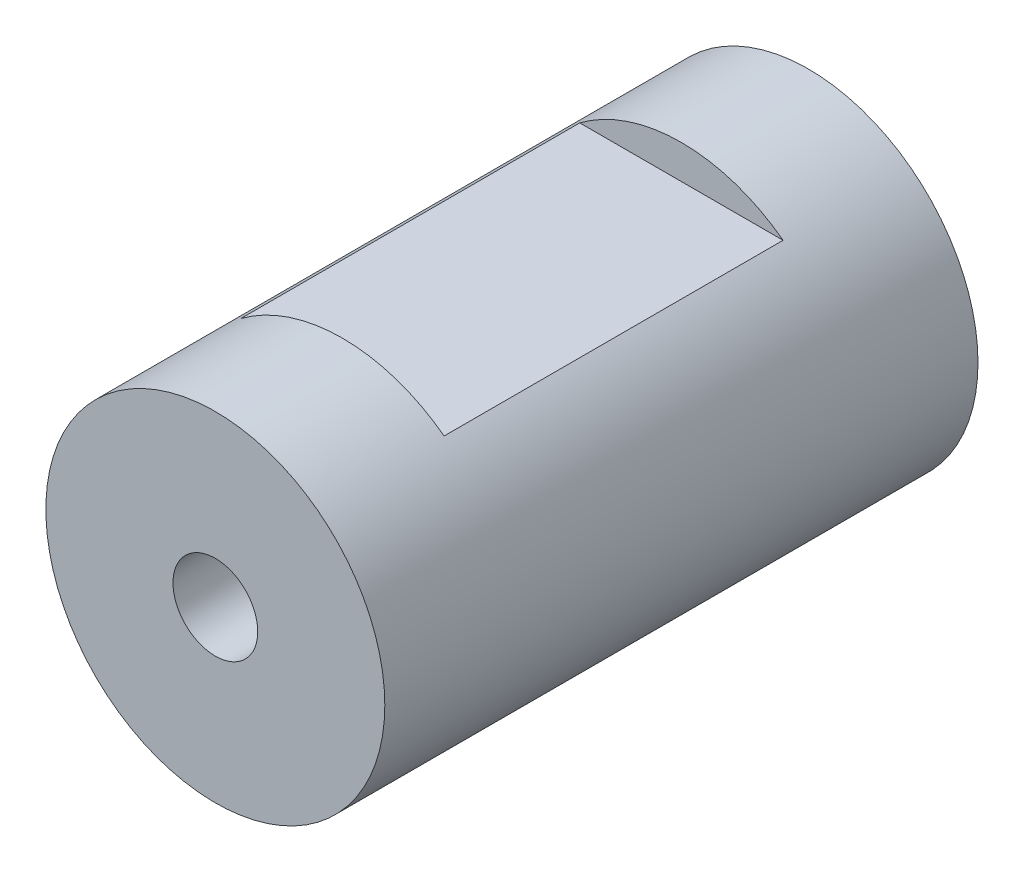
ISO-10303-21;
HEADER;
FILE_DESCRIPTION(('STEP AP214'),'2;1');
FILE_NAME('part.step','',(''),(''),'','','');
FILE_SCHEMA(('AUTOMOTIVE_DESIGN { 1 0 10303 214 1 1 1 1 }'));
ENDSEC;
DATA;
#1=APPLICATION_CONTEXT('core data for automotive mechanical design processes');
#2=APPLICATION_PROTOCOL_DEFINITION('international standard','automotive_design',2000,#1);
#3=PRODUCT_CONTEXT('',#1,'mechanical');
#4=PRODUCT('Part','Part','',(#3));
#5=PRODUCT_RELATED_PRODUCT_CATEGORY('part','',(#4));
#6=PRODUCT_DEFINITION_FORMATION('','',#4);
#7=PRODUCT_DEFINITION_CONTEXT('part definition',#1,'design');
#8=PRODUCT_DEFINITION('design','',#6,#7);
#9=PRODUCT_DEFINITION_SHAPE('','',#8);
#10=(LENGTH_UNIT() NAMED_UNIT(*) SI_UNIT(.MILLI.,.METRE.));
#11=(NAMED_UNIT(*) PLANE_ANGLE_UNIT() SI_UNIT($,.RADIAN.));
#12=(NAMED_UNIT(*) SI_UNIT($,.STERADIAN.) SOLID_ANGLE_UNIT());
#13=UNCERTAINTY_MEASURE_WITH_UNIT(LENGTH_MEASURE(1.E-05),#10,'distance_accuracy_value','');
#14=(GEOMETRIC_REPRESENTATION_CONTEXT(3) GLOBAL_UNCERTAINTY_ASSIGNED_CONTEXT((#13)) GLOBAL_UNIT_ASSIGNED_CONTEXT((#10,
#11,#12)) REPRESENTATION_CONTEXT('',''));
#15=CARTESIAN_POINT('',(0.,0.,0.));
#16=DIRECTION('',(0.,0.,1.));
#17=DIRECTION('',(1.,0.,0.));
#18=AXIS2_PLACEMENT_3D('',#15,#16,#17);
#19=CARTESIAN_POINT('',(0.,0.,-35.));
#20=DIRECTION('',(0.,0.,1.));
#21=DIRECTION('',(1.,0.,0.));
#22=AXIS2_PLACEMENT_3D('',#19,#20,#21);
#23=CYLINDRICAL_SURFACE('',#22,20.);
#24=CARTESIAN_POINT('',(0.,0.,20.));
#25=DIRECTION('',(0.,0.,1.));
#26=DIRECTION('',(1.,0.,0.));
#27=AXIS2_PLACEMENT_3D('',#24,#25,#26);
#28=CIRCLE('',#27,20.);
#29=CARTESIAN_POINT('',(-12.,16.,20.));
#30=VERTEX_POINT('',#29);
#31=CARTESIAN_POINT('',(12.,16.,20.));
#32=VERTEX_POINT('',#31);
#33=EDGE_CURVE('E77',#30,#32,#28,.F.);
#34=ORIENTED_EDGE('',*,*,#33,.F.);
#35=DIRECTION('',(0.,0.,1.));
#36=VECTOR('',#35,1.);
#37=CARTESIAN_POINT('',(-12.,16.,-35.));
#38=LINE('',#37,#36);
#39=CARTESIAN_POINT('',(-12.,16.,-20.));
#40=VERTEX_POINT('',#39);
#41=EDGE_CURVE('E14',#40,#30,#38,.T.);
#42=ORIENTED_EDGE('',*,*,#41,.F.);
#43=CARTESIAN_POINT('',(0.,0.,-20.));
#44=DIRECTION('',(0.,0.,-1.));
#45=DIRECTION('',(-1.,0.,0.));
#46=AXIS2_PLACEMENT_3D('',#43,#44,#45);
#47=CIRCLE('',#46,20.);
#48=CARTESIAN_POINT('',(12.,16.,-20.));
#49=VERTEX_POINT('',#48);
#50=EDGE_CURVE('E60',#49,#40,#47,.F.);
#51=ORIENTED_EDGE('',*,*,#50,.F.);
#52=DIRECTION('',(0.,0.,1.));
#53=VECTOR('',#52,1.);
#54=CARTESIAN_POINT('',(12.,16.,-35.));
#55=LINE('',#54,#53);
#56=EDGE_CURVE('E79',#32,#49,#55,.F.);
#57=ORIENTED_EDGE('',*,*,#56,.F.);
#58=EDGE_LOOP('',(#34,#42,#51,#57));
#59=FACE_BOUND('',#58,.T.);
#60=CARTESIAN_POINT('',(0.,0.,-35.));
#61=DIRECTION('',(0.,0.,1.));
#62=DIRECTION('',(1.,0.,0.));
#63=AXIS2_PLACEMENT_3D('',#60,#61,#62);
#64=CIRCLE('',#63,20.);
#65=CARTESIAN_POINT('',(20.,0.,-35.));
#66=VERTEX_POINT('',#65);
#67=EDGE_CURVE('E83',#66,#66,#64,.T.);
#68=ORIENTED_EDGE('',*,*,#67,.T.);
#69=EDGE_LOOP('',(#68));
#70=FACE_BOUND('',#69,.T.);
#71=CARTESIAN_POINT('',(0.,0.,35.));
#72=DIRECTION('',(0.,0.,1.));
#73=DIRECTION('',(1.,0.,0.));
#74=AXIS2_PLACEMENT_3D('',#71,#72,#73);
#75=CIRCLE('',#74,20.);
#76=CARTESIAN_POINT('',(20.,0.,35.));
#77=VERTEX_POINT('',#76);
#78=EDGE_CURVE('E111',#77,#77,#75,.T.);
#79=ORIENTED_EDGE('',*,*,#78,.F.);
#80=EDGE_LOOP('',(#79));
#81=FACE_BOUND('',#80,.T.);
#82=ADVANCED_FACE('F53',(#59,#70,#81),#23,.T.);
#83=CARTESIAN_POINT('',(0.,0.,-35.));
#84=DIRECTION('',(0.,0.,1.));
#85=DIRECTION('',(1.,0.,0.));
#86=AXIS2_PLACEMENT_3D('',#83,#84,#85);
#87=PLANE('',#86);
#88=CARTESIAN_POINT('',(0.,0.,-35.));
#89=DIRECTION('',(0.,0.,-1.));
#90=DIRECTION('',(-1.,0.,0.));
#91=AXIS2_PLACEMENT_3D('',#88,#89,#90);
#92=CIRCLE('',#91,5.);
#93=CARTESIAN_POINT('',(-4.99999999999999,0.,-35.));
#94=VERTEX_POINT('',#93);
#95=EDGE_CURVE('E108',#94,#94,#92,.F.);
#96=ORIENTED_EDGE('',*,*,#95,.T.);
#97=EDGE_LOOP('',(#96));
#98=FACE_BOUND('',#97,.T.);
#99=ORIENTED_EDGE('',*,*,#67,.F.);
#100=EDGE_LOOP('',(#99));
#101=FACE_BOUND('',#100,.T.);
#102=ADVANCED_FACE('F130',(#98,#101),#87,.F.);
#103=CARTESIAN_POINT('',(0.,0.,35.));
#104=DIRECTION('',(0.,0.,1.));
#105=DIRECTION('',(1.,0.,0.));
#106=AXIS2_PLACEMENT_3D('',#103,#104,#105);
#107=PLANE('',#106);
#108=CARTESIAN_POINT('',(0.,0.,35.));
#109=DIRECTION('',(0.,0.,1.));
#110=DIRECTION('',(1.,0.,0.));
#111=AXIS2_PLACEMENT_3D('',#108,#109,#110);
#112=CIRCLE('',#111,5.);
#113=CARTESIAN_POINT('',(5.,0.,35.));
#114=VERTEX_POINT('',#113);
#115=EDGE_CURVE('E91',#114,#114,#112,.T.);
#116=ORIENTED_EDGE('',*,*,#115,.F.);
#117=EDGE_LOOP('',(#116));
#118=FACE_BOUND('',#117,.T.);
#119=ORIENTED_EDGE('',*,*,#78,.T.);
#120=EDGE_LOOP('',(#119));
#121=FACE_BOUND('',#120,.T.);
#122=ADVANCED_FACE('F134',(#118,#121),#107,.T.);
#123=CARTESIAN_POINT('',(0.,0.,-10.));
#124=DIRECTION('',(0.,0.,-1.));
#125=DIRECTION('',(-1.,0.,0.));
#126=AXIS2_PLACEMENT_3D('',#123,#124,#125);
#127=CYLINDRICAL_SURFACE('',#126,5.);
#128=CARTESIAN_POINT('',(0.,0.,-10.));
#129=DIRECTION('',(-0.707106781186547,0.,-0.707106781186548));
#130=DIRECTION('',(-0.707106781186548,0.,0.707106781186547));
#131=AXIS2_PLACEMENT_3D('',#128,#129,#130);
#132=ELLIPSE('',#131,7.07106781186547,5.);
#133=CARTESIAN_POINT('',(-4.99999999999999,0.,-5.00000000000001));
#134=VERTEX_POINT('',#133);
#135=EDGE_CURVE('E105',#134,#134,#132,.T.);
#136=ORIENTED_EDGE('',*,*,#135,.F.);
#137=EDGE_LOOP('',(#136));
#138=FACE_BOUND('',#137,.T.);
#139=ORIENTED_EDGE('',*,*,#95,.F.);
#140=EDGE_LOOP('',(#139));
#141=FACE_BOUND('',#140,.T.);
#142=ADVANCED_FACE('F140',(#138,#141),#127,.F.);
#143=CARTESIAN_POINT('',(12.,0.,-10.));
#144=DIRECTION('',(-1.,0.,0.));
#145=DIRECTION('',(0.,0.,1.));
#146=AXIS2_PLACEMENT_3D('',#143,#144,#145);
#147=CYLINDRICAL_SURFACE('',#146,5.);
#148=CARTESIAN_POINT('',(12.,0.,-10.));
#149=DIRECTION('',(-0.707106781186547,0.,-0.707106781186548));
#150=DIRECTION('',(0.707106781186548,0.,-0.707106781186547));
#151=AXIS2_PLACEMENT_3D('',#148,#149,#150);
#152=ELLIPSE('',#151,7.07106781186548,5.);
#153=CARTESIAN_POINT('',(17.,0.,-15.));
#154=VERTEX_POINT('',#153);
#155=EDGE_CURVE('E102',#154,#154,#152,.F.);
#156=ORIENTED_EDGE('',*,*,#155,.T.);
#157=EDGE_LOOP('',(#156));
#158=FACE_BOUND('',#157,.T.);
#159=ORIENTED_EDGE('',*,*,#135,.T.);
#160=EDGE_LOOP('',(#159));
#161=FACE_BOUND('',#160,.T.);
#162=ADVANCED_FACE('F146',(#158,#161),#147,.F.);
#163=CARTESIAN_POINT('',(12.,0.,10.));
#164=DIRECTION('',(0.,0.,-1.));
#165=DIRECTION('',(-1.,0.,0.));
#166=AXIS2_PLACEMENT_3D('',#163,#164,#165);
#167=CYLINDRICAL_SURFACE('',#166,5.);
#168=CARTESIAN_POINT('',(12.,0.,10.));
#169=DIRECTION('',(0.707106781186547,0.,-0.707106781186548));
#170=DIRECTION('',(0.707106781186548,0.,0.707106781186547));
#171=AXIS2_PLACEMENT_3D('',#168,#169,#170);
#172=ELLIPSE('',#171,7.07106781186548,5.);
#173=CARTESIAN_POINT('',(17.,0.,15.));
#174=VERTEX_POINT('',#173);
#175=EDGE_CURVE('E99',#174,#174,#172,.T.);
#176=ORIENTED_EDGE('',*,*,#175,.F.);
#177=EDGE_LOOP('',(#176));
#178=FACE_BOUND('',#177,.T.);
#179=ORIENTED_EDGE('',*,*,#155,.F.);
#180=EDGE_LOOP('',(#179));
#181=FACE_BOUND('',#180,.T.);
#182=ADVANCED_FACE('F150',(#178,#181),#167,.F.);
#183=CARTESIAN_POINT('',(0.,0.,10.));
#184=DIRECTION('',(1.,0.,0.));
#185=DIRECTION('',(0.,0.,-1.));
#186=AXIS2_PLACEMENT_3D('',#183,#184,#185);
#187=CYLINDRICAL_SURFACE('',#186,5.);
#188=CARTESIAN_POINT('',(0.,0.,10.));
#189=DIRECTION('',(0.707106781186547,0.,-0.707106781186548));
#190=DIRECTION('',(0.707106781186548,0.,0.707106781186547));
#191=AXIS2_PLACEMENT_3D('',#188,#189,#190);
#192=ELLIPSE('',#191,7.07106781186548,5.);
#193=CARTESIAN_POINT('',(5.,0.,15.));
#194=VERTEX_POINT('',#193);
#195=EDGE_CURVE('E96',#194,#194,#192,.F.);
#196=ORIENTED_EDGE('',*,*,#195,.T.);
#197=EDGE_LOOP('',(#196));
#198=FACE_BOUND('',#197,.T.);
#199=ORIENTED_EDGE('',*,*,#175,.T.);
#200=EDGE_LOOP('',(#199));
#201=FACE_BOUND('',#200,.T.);
#202=ADVANCED_FACE('F125',(#198,#201),#187,.F.);
#203=CARTESIAN_POINT('',(0.,0.,-4.14213562373095));
#204=DIRECTION('',(0.,0.,1.));
#205=DIRECTION('',(1.,0.,0.));
#206=AXIS2_PLACEMENT_3D('',#203,#204,#205);
#207=CYLINDRICAL_SURFACE('',#206,5.);
#208=ORIENTED_EDGE('',*,*,#115,.T.);
#209=EDGE_LOOP('',(#208));
#210=FACE_BOUND('',#209,.T.);
#211=ORIENTED_EDGE('',*,*,#195,.F.);
#212=EDGE_LOOP('',(#211));
#213=FACE_BOUND('',#212,.T.);
#214=ADVANCED_FACE('F118',(#210,#213),#207,.F.);
#215=CARTESIAN_POINT('',(-20.,20.,-20.));
#216=DIRECTION('',(0.,0.,-1.));
#217=DIRECTION('',(-1.,0.,0.));
#218=AXIS2_PLACEMENT_3D('',#215,#216,#217);
#219=PLANE('',#218);
#220=DIRECTION('',(1.,0.,0.));
#221=VECTOR('',#220,1.);
#222=CARTESIAN_POINT('',(-20.,16.,-20.));
#223=LINE('',#222,#221);
#224=EDGE_CURVE('E88',#40,#49,#223,.T.);
#225=ORIENTED_EDGE('',*,*,#224,.T.);
#226=ORIENTED_EDGE('',*,*,#50,.T.);
#227=EDGE_LOOP('',(#225,#226));
#228=FACE_BOUND('',#227,.T.);
#229=ADVANCED_FACE('F116',(#228),#219,.F.);
#230=CARTESIAN_POINT('',(-20.,16.,-20.));
#231=DIRECTION('',(0.,-1.,0.));
#232=DIRECTION('',(0.,0.,-1.));
#233=AXIS2_PLACEMENT_3D('',#230,#231,#232);
#234=PLANE('',#233);
#235=ORIENTED_EDGE('',*,*,#56,.T.);
#236=ORIENTED_EDGE('',*,*,#224,.F.);
#237=ORIENTED_EDGE('',*,*,#41,.T.);
#238=DIRECTION('',(1.,0.,0.));
#239=VECTOR('',#238,1.);
#240=CARTESIAN_POINT('',(-20.,16.,20.));
#241=LINE('',#240,#239);
#242=EDGE_CURVE('E87',#30,#32,#241,.T.);
#243=ORIENTED_EDGE('',*,*,#242,.T.);
#244=EDGE_LOOP('',(#235,#236,#237,#243));
#245=FACE_BOUND('',#244,.T.);
#246=ADVANCED_FACE('F86',(#245),#234,.F.);
#247=CARTESIAN_POINT('',(-20.,20.,20.));
#248=DIRECTION('',(0.,0.,1.));
#249=DIRECTION('',(1.,0.,0.));
#250=AXIS2_PLACEMENT_3D('',#247,#248,#249);
#251=PLANE('',#250);
#252=ORIENTED_EDGE('',*,*,#242,.F.);
#253=ORIENTED_EDGE('',*,*,#33,.T.);
#254=EDGE_LOOP('',(#252,#253));
#255=FACE_BOUND('',#254,.T.);
#256=ADVANCED_FACE('F89',(#255),#251,.F.);
#257=CLOSED_SHELL('',(#82,#102,#122,#142,#162,#182,#202,#214,#229,#246,#256));
#258=MANIFOLD_SOLID_BREP('B2',#257);
#259=ADVANCED_BREP_SHAPE_REPRESENTATION('',(#18,#258),#14);
#260=SHAPE_DEFINITION_REPRESENTATION(#9,#259);
ENDSEC;
END-ISO-10303-21;
